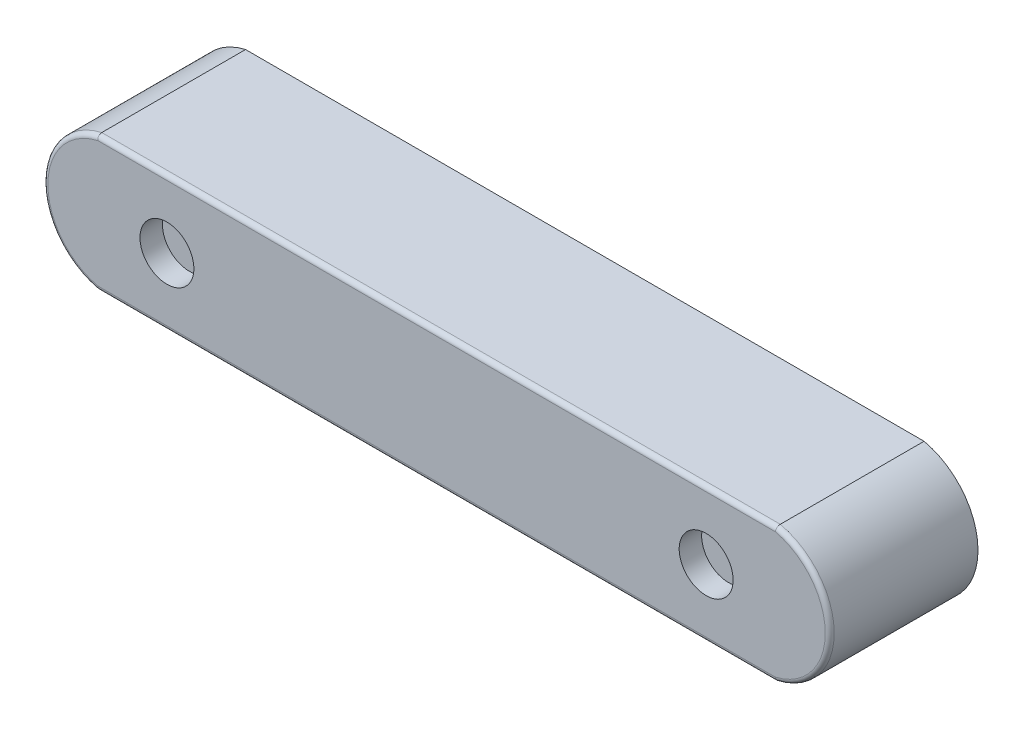
ISO-10303-21;
HEADER;
FILE_DESCRIPTION(('STEP AP214'),'2;1');
FILE_NAME('part.step','',(''),(''),'','','');
FILE_SCHEMA(('AUTOMOTIVE_DESIGN { 1 0 10303 214 1 1 1 1 }'));
ENDSEC;
DATA;
#1=APPLICATION_CONTEXT('core data for automotive mechanical design processes');
#2=APPLICATION_PROTOCOL_DEFINITION('international standard','automotive_design',2000,#1);
#3=PRODUCT_CONTEXT('',#1,'mechanical');
#4=PRODUCT('Part','Part','',(#3));
#5=PRODUCT_RELATED_PRODUCT_CATEGORY('part','',(#4));
#6=PRODUCT_DEFINITION_FORMATION('','',#4);
#7=PRODUCT_DEFINITION_CONTEXT('part definition',#1,'design');
#8=PRODUCT_DEFINITION('design','',#6,#7);
#9=PRODUCT_DEFINITION_SHAPE('','',#8);
#10=(LENGTH_UNIT() NAMED_UNIT(*) SI_UNIT(.MILLI.,.METRE.));
#11=(NAMED_UNIT(*) PLANE_ANGLE_UNIT() SI_UNIT($,.RADIAN.));
#12=(NAMED_UNIT(*) SI_UNIT($,.STERADIAN.) SOLID_ANGLE_UNIT());
#13=UNCERTAINTY_MEASURE_WITH_UNIT(LENGTH_MEASURE(1.E-05),#10,'distance_accuracy_value','');
#14=(GEOMETRIC_REPRESENTATION_CONTEXT(3) GLOBAL_UNCERTAINTY_ASSIGNED_CONTEXT((#13)) GLOBAL_UNIT_ASSIGNED_CONTEXT((#10,
#11,#12)) REPRESENTATION_CONTEXT('',''));
#15=CARTESIAN_POINT('',(0.,0.,0.));
#16=DIRECTION('',(0.,0.,1.));
#17=DIRECTION('',(1.,0.,0.));
#18=AXIS2_PLACEMENT_3D('',#15,#16,#17);
#19=CARTESIAN_POINT('',(-72.125,0.,33.));
#20=DIRECTION('',(0.,0.,-1.));
#21=DIRECTION('',(-1.,0.,0.));
#22=AXIS2_PLACEMENT_3D('',#19,#20,#21);
#23=CYLINDRICAL_SURFACE('',#22,15.375);
#24=DIRECTION('',(0.,0.,-1.));
#25=VECTOR('',#24,1.);
#26=CARTESIAN_POINT('',(-75.5,-15.,33.));
#27=LINE('',#26,#25);
#28=CARTESIAN_POINT('',(-75.5,-15.,32.));
#29=VERTEX_POINT('',#28);
#30=CARTESIAN_POINT('',(-75.5,-15.,0.));
#31=VERTEX_POINT('',#30);
#32=EDGE_CURVE('E88',#29,#31,#27,.T.);
#33=ORIENTED_EDGE('',*,*,#32,.F.);
#34=CARTESIAN_POINT('',(-72.125,0.,32.));
#35=DIRECTION('',(0.,0.,1.));
#36=DIRECTION('',(1.,0.,0.));
#37=AXIS2_PLACEMENT_3D('',#34,#35,#36);
#38=CIRCLE('',#37,15.375);
#39=CARTESIAN_POINT('',(-75.5,15.,32.));
#40=VERTEX_POINT('',#39);
#41=EDGE_CURVE('E44',#29,#40,#38,.F.);
#42=ORIENTED_EDGE('',*,*,#41,.T.);
#43=DIRECTION('',(0.,0.,-1.));
#44=VECTOR('',#43,1.);
#45=CARTESIAN_POINT('',(-75.5,15.,33.));
#46=LINE('',#45,#44);
#47=CARTESIAN_POINT('',(-75.5,15.,0.));
#48=VERTEX_POINT('',#47);
#49=EDGE_CURVE('E108',#40,#48,#46,.T.);
#50=ORIENTED_EDGE('',*,*,#49,.T.);
#51=CARTESIAN_POINT('',(-72.125,0.,0.));
#52=DIRECTION('',(0.,0.,1.));
#53=DIRECTION('',(1.,0.,0.));
#54=AXIS2_PLACEMENT_3D('',#51,#52,#53);
#55=CIRCLE('',#54,15.375);
#56=EDGE_CURVE('E103',#48,#31,#55,.T.);
#57=ORIENTED_EDGE('',*,*,#56,.T.);
#58=EDGE_LOOP('',(#33,#42,#50,#57));
#59=FACE_BOUND('',#58,.T.);
#60=ADVANCED_FACE('F35',(#59),#23,.T.);
#61=CARTESIAN_POINT('',(-75.5,-15.,33.));
#62=DIRECTION('',(0.,1.,0.));
#63=DIRECTION('',(-1.,0.,0.));
#64=AXIS2_PLACEMENT_3D('',#61,#62,#63);
#65=PLANE('',#64);
#66=CARTESIAN_POINT('',(0.,-15.,15.6));
#67=DIRECTION('',(0.,-1.,0.));
#68=DIRECTION('',(1.,0.,0.));
#69=AXIS2_PLACEMENT_3D('',#66,#67,#68);
#70=CIRCLE('',#69,4.46);
#71=CARTESIAN_POINT('',(4.45999999999999,-15.,15.6));
#72=VERTEX_POINT('',#71);
#73=EDGE_CURVE('E382',#72,#72,#70,.T.);
#74=ORIENTED_EDGE('',*,*,#73,.F.);
#75=EDGE_LOOP('',(#74));
#76=FACE_BOUND('',#75,.T.);
#77=DIRECTION('',(0.,0.,-1.));
#78=VECTOR('',#77,1.);
#79=CARTESIAN_POINT('',(75.5,-15.,33.));
#80=LINE('',#79,#78);
#81=CARTESIAN_POINT('',(75.5,-15.,32.));
#82=VERTEX_POINT('',#81);
#83=CARTESIAN_POINT('',(75.5,-15.,0.));
#84=VERTEX_POINT('',#83);
#85=EDGE_CURVE('E97',#82,#84,#80,.T.);
#86=ORIENTED_EDGE('',*,*,#85,.F.);
#87=DIRECTION('',(1.,0.,0.));
#88=VECTOR('',#87,1.);
#89=CARTESIAN_POINT('',(-75.5,-15.,32.));
#90=LINE('',#89,#88);
#91=EDGE_CURVE('E51',#82,#29,#90,.F.);
#92=ORIENTED_EDGE('',*,*,#91,.T.);
#93=ORIENTED_EDGE('',*,*,#32,.T.);
#94=DIRECTION('',(1.,0.,0.));
#95=VECTOR('',#94,1.);
#96=CARTESIAN_POINT('',(-75.5,-15.,0.));
#97=LINE('',#96,#95);
#98=EDGE_CURVE('E91',#31,#84,#97,.T.);
#99=ORIENTED_EDGE('',*,*,#98,.T.);
#100=EDGE_LOOP('',(#86,#92,#93,#99));
#101=FACE_BOUND('',#100,.T.);
#102=ADVANCED_FACE('F90',(#76,#101),#65,.F.);
#103=CARTESIAN_POINT('',(72.125,0.,33.));
#104=DIRECTION('',(0.,0.,-1.));
#105=DIRECTION('',(-1.,0.,0.));
#106=AXIS2_PLACEMENT_3D('',#103,#104,#105);
#107=CYLINDRICAL_SURFACE('',#106,15.375);
#108=DIRECTION('',(0.,0.,-1.));
#109=VECTOR('',#108,1.);
#110=CARTESIAN_POINT('',(75.5,15.,33.));
#111=LINE('',#110,#109);
#112=CARTESIAN_POINT('',(75.5,15.,32.));
#113=VERTEX_POINT('',#112);
#114=CARTESIAN_POINT('',(75.5,15.,0.));
#115=VERTEX_POINT('',#114);
#116=EDGE_CURVE('E122',#113,#115,#111,.T.);
#117=ORIENTED_EDGE('',*,*,#116,.F.);
#118=CARTESIAN_POINT('',(72.125,0.,32.));
#119=DIRECTION('',(0.,0.,1.));
#120=DIRECTION('',(1.,0.,0.));
#121=AXIS2_PLACEMENT_3D('',#118,#119,#120);
#122=CIRCLE('',#121,15.375);
#123=EDGE_CURVE('E59',#113,#82,#122,.F.);
#124=ORIENTED_EDGE('',*,*,#123,.T.);
#125=ORIENTED_EDGE('',*,*,#85,.T.);
#126=CARTESIAN_POINT('',(72.125,0.,0.));
#127=DIRECTION('',(0.,0.,1.));
#128=DIRECTION('',(-1.,0.,0.));
#129=AXIS2_PLACEMENT_3D('',#126,#127,#128);
#130=CIRCLE('',#129,15.375);
#131=EDGE_CURVE('E105',#84,#115,#130,.T.);
#132=ORIENTED_EDGE('',*,*,#131,.T.);
#133=EDGE_LOOP('',(#117,#124,#125,#132));
#134=FACE_BOUND('',#133,.T.);
#135=ADVANCED_FACE('F181',(#134),#107,.T.);
#136=CARTESIAN_POINT('',(-75.5,15.,33.));
#137=DIRECTION('',(0.,-1.,0.));
#138=DIRECTION('',(0.,0.,-1.));
#139=AXIS2_PLACEMENT_3D('',#136,#137,#138);
#140=PLANE('',#139);
#141=ORIENTED_EDGE('',*,*,#49,.F.);
#142=DIRECTION('',(-1.,0.,0.));
#143=VECTOR('',#142,1.);
#144=CARTESIAN_POINT('',(75.5,15.,32.));
#145=LINE('',#144,#143);
#146=EDGE_CURVE('E133',#40,#113,#145,.F.);
#147=ORIENTED_EDGE('',*,*,#146,.T.);
#148=ORIENTED_EDGE('',*,*,#116,.T.);
#149=DIRECTION('',(-1.,0.,0.));
#150=VECTOR('',#149,1.);
#151=CARTESIAN_POINT('',(-75.5,15.,0.));
#152=LINE('',#151,#150);
#153=EDGE_CURVE('E119',#115,#48,#152,.T.);
#154=ORIENTED_EDGE('',*,*,#153,.T.);
#155=EDGE_LOOP('',(#141,#147,#148,#154));
#156=FACE_BOUND('',#155,.T.);
#157=ADVANCED_FACE('F180',(#156),#140,.F.);
#158=CARTESIAN_POINT('',(-72.125,0.,33.));
#159=DIRECTION('',(0.,0.,1.));
#160=DIRECTION('',(1.,0.,0.));
#161=AXIS2_PLACEMENT_3D('',#158,#159,#160);
#162=PLANE('',#161);
#163=CARTESIAN_POINT('',(60.,0.,33.));
#164=DIRECTION('',(0.,0.,1.));
#165=DIRECTION('',(1.,0.,0.));
#166=AXIS2_PLACEMENT_3D('',#163,#164,#165);
#167=CIRCLE('',#166,5.99999999999999);
#168=CARTESIAN_POINT('',(66.,0.,33.));
#169=VERTEX_POINT('',#168);
#170=EDGE_CURVE('E387',#169,#169,#167,.T.);
#171=ORIENTED_EDGE('',*,*,#170,.F.);
#172=EDGE_LOOP('',(#171));
#173=FACE_BOUND('',#172,.T.);
#174=CARTESIAN_POINT('',(-60.,0.,33.));
#175=DIRECTION('',(0.,0.,1.));
#176=DIRECTION('',(1.,0.,0.));
#177=AXIS2_PLACEMENT_3D('',#174,#175,#176);
#178=CIRCLE('',#177,6.);
#179=CARTESIAN_POINT('',(-54.,0.,33.));
#180=VERTEX_POINT('',#179);
#181=EDGE_CURVE('E115',#180,#180,#178,.T.);
#182=ORIENTED_EDGE('',*,*,#181,.F.);
#183=EDGE_LOOP('',(#182));
#184=FACE_BOUND('',#183,.T.);
#185=CARTESIAN_POINT('',(72.125,0.,33.));
#186=DIRECTION('',(0.,0.,1.));
#187=DIRECTION('',(1.,0.,0.));
#188=AXIS2_PLACEMENT_3D('',#185,#186,#187);
#189=CIRCLE('',#188,14.375);
#190=CARTESIAN_POINT('',(75.386997087675,-14.,33.));
#191=VERTEX_POINT('',#190);
#192=CARTESIAN_POINT('',(75.386997087675,14.,33.));
#193=VERTEX_POINT('',#192);
#194=EDGE_CURVE('E128',#191,#193,#189,.T.);
#195=ORIENTED_EDGE('',*,*,#194,.T.);
#196=DIRECTION('',(-1.,0.,0.));
#197=VECTOR('',#196,1.);
#198=CARTESIAN_POINT('',(-75.5,14.,33.));
#199=LINE('',#198,#197);
#200=CARTESIAN_POINT('',(-75.386997087675,14.,33.));
#201=VERTEX_POINT('',#200);
#202=EDGE_CURVE('E130',#193,#201,#199,.T.);
#203=ORIENTED_EDGE('',*,*,#202,.T.);
#204=CARTESIAN_POINT('',(-72.125,0.,33.));
#205=DIRECTION('',(0.,0.,1.));
#206=DIRECTION('',(1.,0.,0.));
#207=AXIS2_PLACEMENT_3D('',#204,#205,#206);
#208=CIRCLE('',#207,14.375);
#209=CARTESIAN_POINT('',(-75.386997087675,-14.,33.));
#210=VERTEX_POINT('',#209);
#211=EDGE_CURVE('E96',#201,#210,#208,.T.);
#212=ORIENTED_EDGE('',*,*,#211,.T.);
#213=DIRECTION('',(1.,0.,0.));
#214=VECTOR('',#213,1.);
#215=CARTESIAN_POINT('',(75.5,-14.,33.));
#216=LINE('',#215,#214);
#217=EDGE_CURVE('E126',#210,#191,#216,.T.);
#218=ORIENTED_EDGE('',*,*,#217,.T.);
#219=EDGE_LOOP('',(#195,#203,#212,#218));
#220=FACE_BOUND('',#219,.T.);
#221=ADVANCED_FACE('F185',(#173,#184,#220),#162,.T.);
#222=CARTESIAN_POINT('',(-72.125,0.,0.));
#223=DIRECTION('',(0.,0.,1.));
#224=DIRECTION('',(1.,0.,0.));
#225=AXIS2_PLACEMENT_3D('',#222,#223,#224);
#226=PLANE('',#225);
#227=CARTESIAN_POINT('',(0.,-9.99999999999997,0.));
#228=DIRECTION('',(0.,0.,1.));
#229=DIRECTION('',(1.,0.,0.));
#230=AXIS2_PLACEMENT_3D('',#227,#228,#229);
#231=CIRCLE('',#230,2.);
#232=CARTESIAN_POINT('',(2.,-9.99999999999997,0.));
#233=VERTEX_POINT('',#232);
#234=EDGE_CURVE('E11',#233,#233,#231,.F.);
#235=ORIENTED_EDGE('',*,*,#234,.F.);
#236=EDGE_LOOP('',(#235));
#237=FACE_BOUND('',#236,.T.);
#238=ORIENTED_EDGE('',*,*,#56,.F.);
#239=ORIENTED_EDGE('',*,*,#153,.F.);
#240=ORIENTED_EDGE('',*,*,#131,.F.);
#241=ORIENTED_EDGE('',*,*,#98,.F.);
#242=EDGE_LOOP('',(#238,#239,#240,#241));
#243=FACE_BOUND('',#242,.T.);
#244=ADVANCED_FACE('F101',(#237,#243),#226,.F.);
#245=CARTESIAN_POINT('',(-72.125,-14.,32.));
#246=DIRECTION('',(-1.,0.,0.));
#247=DIRECTION('',(0.,-1.,0.));
#248=AXIS2_PLACEMENT_3D('',#245,#246,#247);
#249=CYLINDRICAL_SURFACE('',#248,1.);
#250=CARTESIAN_POINT('',(-75.5,-15.,32.));
#251=CARTESIAN_POINT('',(-75.499999964674,-14.999999904069,32.0280075921913));
#252=CARTESIAN_POINT('',(-75.4998691822479,-14.9988226159024,32.0560017235617));
#253=CARTESIAN_POINT('',(-75.4993473457388,-14.994126545182,32.111788744704));
#254=CARTESIAN_POINT('',(-75.4989563071951,-14.990607902425,32.1395816463908));
#255=CARTESIAN_POINT('',(-75.4973964411671,-14.9765754690892,32.2223053710667));
#256=CARTESIAN_POINT('',(-75.4958408530623,-14.9625850690083,32.2766805353644));
#257=CARTESIAN_POINT('',(-75.4917389311392,-14.9257358300069,32.3822915327908));
#258=CARTESIAN_POINT('',(-75.4891921831668,-14.9028732838908,32.4335260432318));
#259=CARTESIAN_POINT('',(-75.4831760705017,-14.8489500074775,32.5314170414158));
#260=CARTESIAN_POINT('',(-75.4797068777712,-14.817890805209,32.5780743802183));
#261=CARTESIAN_POINT('',(-75.4719277514656,-14.7483803307268,32.6656276557366));
#262=CARTESIAN_POINT('',(-75.467615658569,-14.7099100768017,32.7065083204121));
#263=CARTESIAN_POINT('',(-75.4582695340125,-14.6267186595717,32.7812495970753));
#264=CARTESIAN_POINT('',(-75.4532352604924,-14.5819954022474,32.8151078479097));
#265=CARTESIAN_POINT('',(-75.442548278371,-14.4872971608125,32.8750440828348));
#266=CARTESIAN_POINT('',(-75.4368920058979,-14.4372919849175,32.9010736599481));
#267=CARTESIAN_POINT('',(-75.4251400590818,-14.333686700491,32.944350918401));
#268=CARTESIAN_POINT('',(-75.4190447224892,-14.2800893573992,32.9616052694441));
#269=CARTESIAN_POINT('',(-75.4088437740247,-14.1906520506433,32.982310761774));
#270=CARTESIAN_POINT('',(-75.4048168093767,-14.1554090048299,32.9884976778408));
#271=CARTESIAN_POINT('',(-75.3967000469693,-14.0845064076868,32.9970603308654));
#272=CARTESIAN_POINT('',(-75.3926103598681,-14.0488476117025,32.9994421406602));
#273=CARTESIAN_POINT('',(-75.3880078302292,-14.0087931211266,32.9999710700288));
#274=CARTESIAN_POINT('',(-75.3875024916347,-14.0043963299809,33.0000000762739));
#275=CARTESIAN_POINT('',(-75.386997087675,-14.,33.));
#276=B_SPLINE_CURVE_WITH_KNOTS('',3,(#250,#251,#252,#253,#254,#255,#256,#257,#258,#259,#260,
#261,#262,#263,#264,#265,#266,#267,#268,#269,#270,#271,#272,#273,#274,#275),.UNSPECIFIED.,.F.,
.F.,(4,2,2,2,2,2,2,2,2,2,2,2,4),(0.,0.0839710221818349,0.167937031096377,0.335574886844235,
0.503282865041634,0.670959601007382,0.839071653897695,1.00724013997061,1.17642803841149,
1.34548715089566,1.45333498703413,1.56101052864617,1.57428757464835),.UNSPECIFIED.);
#277=EDGE_CURVE('E113',#29,#210,#276,.T.);
#278=ORIENTED_EDGE('',*,*,#277,.F.);
#279=ORIENTED_EDGE('',*,*,#91,.F.);
#280=CARTESIAN_POINT('',(75.5,-15.,32.));
#281=CARTESIAN_POINT('',(75.499999964674,-14.999999904069,32.0280075921913));
#282=CARTESIAN_POINT('',(75.4998691822479,-14.9988226159024,32.0560017235617));
#283=CARTESIAN_POINT('',(75.4993473457388,-14.9941265451819,32.111788744704));
#284=CARTESIAN_POINT('',(75.4989563071951,-14.990607902425,32.1395816463908));
#285=CARTESIAN_POINT('',(75.497396441167,-14.9765754690891,32.2223053710667));
#286=CARTESIAN_POINT('',(75.4958408530623,-14.9625850690083,32.2766805353644));
#287=CARTESIAN_POINT('',(75.4917389311392,-14.9257358300068,32.3822915327908));
#288=CARTESIAN_POINT('',(75.4891921831668,-14.9028732838908,32.4335260432318));
#289=CARTESIAN_POINT('',(75.4831760705017,-14.8489500074774,32.5314170414158));
#290=CARTESIAN_POINT('',(75.4797068777712,-14.817890805209,32.5780743802183));
#291=CARTESIAN_POINT('',(75.4719277514656,-14.7483803307268,32.6656276557366));
#292=CARTESIAN_POINT('',(75.4676156585689,-14.7099100768017,32.7065083204121));
#293=CARTESIAN_POINT('',(75.4582695340124,-14.6267186595717,32.7812495970753));
#294=CARTESIAN_POINT('',(75.4532352604923,-14.5819954022473,32.8151078479097));
#295=CARTESIAN_POINT('',(75.442548278371,-14.4872971608125,32.8750440828348));
#296=CARTESIAN_POINT('',(75.4368920058979,-14.4372919849175,32.9010736599481));
#297=CARTESIAN_POINT('',(75.4251400590817,-14.333686700491,32.944350918401));
#298=CARTESIAN_POINT('',(75.4190447224892,-14.2800893573992,32.9616052694441));
#299=CARTESIAN_POINT('',(75.4088437740247,-14.1906520506432,32.982310761774));
#300=CARTESIAN_POINT('',(75.4048168093766,-14.1554090048299,32.9884976778408));
#301=CARTESIAN_POINT('',(75.3967000469693,-14.0845064076868,32.9970603308654));
#302=CARTESIAN_POINT('',(75.3926103598681,-14.0488476117024,32.9994421406602));
#303=CARTESIAN_POINT('',(75.3880078302292,-14.0087931211265,32.9999710700288));
#304=CARTESIAN_POINT('',(75.3875024916347,-14.0043963299809,33.0000000762739));
#305=CARTESIAN_POINT('',(75.3869970876749,-14.,33.));
#306=B_SPLINE_CURVE_WITH_KNOTS('',3,(#280,#281,#282,#283,#284,#285,#286,#287,#288,#289,#290,
#291,#292,#293,#294,#295,#296,#297,#298,#299,#300,#301,#302,#303,#304,#305),.UNSPECIFIED.,.F.,
.F.,(4,2,2,2,2,2,2,2,2,2,2,2,4),(0.,0.0839710221818349,0.167937031096377,0.335574886844235,
0.503282865041625,0.670959601007382,0.83907165389769,1.00724013997061,1.17642803841149,
1.34548715089566,1.45333498703413,1.56101052864617,1.57428757464835),.UNSPECIFIED.);
#307=EDGE_CURVE('E110',#191,#82,#306,.F.);
#308=ORIENTED_EDGE('',*,*,#307,.F.);
#309=ORIENTED_EDGE('',*,*,#217,.F.);
#310=EDGE_LOOP('',(#278,#279,#308,#309));
#311=FACE_BOUND('',#310,.T.);
#312=ADVANCED_FACE('F37',(#311),#249,.T.);
#313=CARTESIAN_POINT('',(72.125,0.,32.));
#314=DIRECTION('',(0.,0.,1.));
#315=DIRECTION('',(1.,0.,0.));
#316=AXIS2_PLACEMENT_3D('',#313,#314,#315);
#317=TOROIDAL_SURFACE('',#316,14.375,1.);
#318=ORIENTED_EDGE('',*,*,#307,.T.);
#319=ORIENTED_EDGE('',*,*,#123,.F.);
#320=CARTESIAN_POINT('',(75.5,15.,32.));
#321=CARTESIAN_POINT('',(75.499999964674,14.9999999040689,32.0280075921913));
#322=CARTESIAN_POINT('',(75.4998691822479,14.9988226159024,32.0560017235617));
#323=CARTESIAN_POINT('',(75.4993473457388,14.9941265451819,32.111788744704));
#324=CARTESIAN_POINT('',(75.4989563071951,14.990607902425,32.1395816463908));
#325=CARTESIAN_POINT('',(75.497396441167,14.9765754690891,32.2223053710667));
#326=CARTESIAN_POINT('',(75.4958408530623,14.9625850690083,32.2766805353644));
#327=CARTESIAN_POINT('',(75.4917389311392,14.9257358300068,32.3822915327908));
#328=CARTESIAN_POINT('',(75.4891921831668,14.9028732838908,32.4335260432318));
#329=CARTESIAN_POINT('',(75.4831760705017,14.8489500074774,32.5314170414158));
#330=CARTESIAN_POINT('',(75.4797068777712,14.817890805209,32.5780743802183));
#331=CARTESIAN_POINT('',(75.4719277514656,14.7483803307268,32.6656276557366));
#332=CARTESIAN_POINT('',(75.4676156585689,14.7099100768016,32.7065083204121));
#333=CARTESIAN_POINT('',(75.4582695340124,14.6267186595717,32.7812495970753));
#334=CARTESIAN_POINT('',(75.4532352604924,14.5819954022473,32.8151078479097));
#335=CARTESIAN_POINT('',(75.442548278371,14.4872971608125,32.8750440828348));
#336=CARTESIAN_POINT('',(75.4368920058979,14.4372919849175,32.9010736599481));
#337=CARTESIAN_POINT('',(75.4251400590818,14.333686700491,32.944350918401));
#338=CARTESIAN_POINT('',(75.4190447224892,14.2800893573992,32.9616052694441));
#339=CARTESIAN_POINT('',(75.4088437740246,14.1906520506432,32.982310761774));
#340=CARTESIAN_POINT('',(75.4048168093766,14.1554090048299,32.9884976778408));
#341=CARTESIAN_POINT('',(75.3967000469694,14.0845064076868,32.9970603308654));
#342=CARTESIAN_POINT('',(75.3926103598683,14.0488476117024,32.9994421406602));
#343=CARTESIAN_POINT('',(75.3880078302292,14.0087931211265,32.9999710700288));
#344=CARTESIAN_POINT('',(75.3875024916347,14.0043963299809,33.0000000762739));
#345=CARTESIAN_POINT('',(75.386997087675,14.,33.));
#346=B_SPLINE_CURVE_WITH_KNOTS('',3,(#320,#321,#322,#323,#324,#325,#326,#327,#328,#329,#330,
#331,#332,#333,#334,#335,#336,#337,#338,#339,#340,#341,#342,#343,#344,#345),.UNSPECIFIED.,.F.,
.F.,(4,2,2,2,2,2,2,2,2,2,2,2,4),(0.,0.0839710221818349,0.167937031096377,0.335574886844235,
0.503282865041626,0.670959601007382,0.839071653897696,1.00724013997061,1.17642803841149,
1.34548715089566,1.45333498703413,1.56101052864616,1.57428757464835),.UNSPECIFIED.);
#347=EDGE_CURVE('E146',#193,#113,#346,.F.);
#348=ORIENTED_EDGE('',*,*,#347,.F.);
#349=ORIENTED_EDGE('',*,*,#194,.F.);
#350=EDGE_LOOP('',(#318,#319,#348,#349));
#351=FACE_BOUND('',#350,.T.);
#352=ADVANCED_FACE('F158',(#351),#317,.T.);
#353=CARTESIAN_POINT('',(-72.125,0.,32.));
#354=DIRECTION('',(0.,0.,1.));
#355=DIRECTION('',(1.,0.,0.));
#356=AXIS2_PLACEMENT_3D('',#353,#354,#355);
#357=TOROIDAL_SURFACE('',#356,14.375,1.);
#358=ORIENTED_EDGE('',*,*,#277,.T.);
#359=ORIENTED_EDGE('',*,*,#211,.F.);
#360=CARTESIAN_POINT('',(-75.5,15.,32.));
#361=CARTESIAN_POINT('',(-75.499999964674,14.9999999040689,32.0280075921913));
#362=CARTESIAN_POINT('',(-75.4998691822479,14.9988226159024,32.0560017235617));
#363=CARTESIAN_POINT('',(-75.4993473457388,14.9941265451819,32.111788744704));
#364=CARTESIAN_POINT('',(-75.4989563071951,14.990607902425,32.1395816463908));
#365=CARTESIAN_POINT('',(-75.4973964411671,14.9765754690891,32.2223053710667));
#366=CARTESIAN_POINT('',(-75.4958408530623,14.9625850690083,32.2766805353644));
#367=CARTESIAN_POINT('',(-75.4917389311392,14.9257358300068,32.3822915327908));
#368=CARTESIAN_POINT('',(-75.4891921831668,14.9028732838908,32.4335260432318));
#369=CARTESIAN_POINT('',(-75.4831760705017,14.8489500074774,32.5314170414158));
#370=CARTESIAN_POINT('',(-75.4797068777712,14.817890805209,32.5780743802183));
#371=CARTESIAN_POINT('',(-75.4719277514656,14.7483803307268,32.6656276557366));
#372=CARTESIAN_POINT('',(-75.467615658569,14.7099100768016,32.7065083204121));
#373=CARTESIAN_POINT('',(-75.4582695340125,14.6267186595717,32.7812495970753));
#374=CARTESIAN_POINT('',(-75.4532352604924,14.5819954022473,32.8151078479097));
#375=CARTESIAN_POINT('',(-75.442548278371,14.4872971608125,32.8750440828348));
#376=CARTESIAN_POINT('',(-75.4368920058979,14.4372919849175,32.9010736599481));
#377=CARTESIAN_POINT('',(-75.4251400590818,14.333686700491,32.944350918401));
#378=CARTESIAN_POINT('',(-75.4190447224893,14.2800893573992,32.9616052694441));
#379=CARTESIAN_POINT('',(-75.4088437740247,14.1906520506432,32.982310761774));
#380=CARTESIAN_POINT('',(-75.4048168093766,14.1554090048299,32.9884976778408));
#381=CARTESIAN_POINT('',(-75.3967000469694,14.0845064076868,32.9970603308654));
#382=CARTESIAN_POINT('',(-75.3926103598685,14.0488476117024,32.9994421406602));
#383=CARTESIAN_POINT('',(-75.3880078302293,14.0087931211265,32.9999710700288));
#384=CARTESIAN_POINT('',(-75.3875024916348,14.0043963299809,33.0000000762739));
#385=CARTESIAN_POINT('',(-75.386997087675,14.,33.));
#386=B_SPLINE_CURVE_WITH_KNOTS('',3,(#360,#361,#362,#363,#364,#365,#366,#367,#368,#369,#370,
#371,#372,#373,#374,#375,#376,#377,#378,#379,#380,#381,#382,#383,#384,#385),.UNSPECIFIED.,.F.,
.F.,(4,2,2,2,2,2,2,2,2,2,2,2,4),(0.,0.0839710221818349,0.167937031096377,0.335574886844235,
0.503282865041625,0.670959601007383,0.839071653897696,1.00724013997061,1.17642803841149,
1.34548715089566,1.45333498703413,1.56101052864617,1.57428757464835),.UNSPECIFIED.);
#387=EDGE_CURVE('E139',#40,#201,#386,.T.);
#388=ORIENTED_EDGE('',*,*,#387,.F.);
#389=ORIENTED_EDGE('',*,*,#41,.F.);
#390=EDGE_LOOP('',(#358,#359,#388,#389));
#391=FACE_BOUND('',#390,.T.);
#392=ADVANCED_FACE('F155',(#391),#357,.T.);
#393=CARTESIAN_POINT('',(-72.125,14.,32.));
#394=DIRECTION('',(1.,0.,0.));
#395=DIRECTION('',(0.,0.,-1.));
#396=AXIS2_PLACEMENT_3D('',#393,#394,#395);
#397=CYLINDRICAL_SURFACE('',#396,1.);
#398=ORIENTED_EDGE('',*,*,#347,.T.);
#399=ORIENTED_EDGE('',*,*,#146,.F.);
#400=ORIENTED_EDGE('',*,*,#387,.T.);
#401=ORIENTED_EDGE('',*,*,#202,.F.);
#402=EDGE_LOOP('',(#398,#399,#400,#401));
#403=FACE_BOUND('',#402,.T.);
#404=ADVANCED_FACE('F152',(#403),#397,.T.);
#405=CARTESIAN_POINT('',(-60.,0.,28.));
#406=DIRECTION('',(0.,0.,1.));
#407=DIRECTION('',(1.,0.,0.));
#408=AXIS2_PLACEMENT_3D('',#405,#406,#407);
#409=CYLINDRICAL_SURFACE('',#408,6.);
#410=CARTESIAN_POINT('',(-60.,0.,28.));
#411=DIRECTION('',(0.,0.,1.));
#412=DIRECTION('',(1.,0.,0.));
#413=AXIS2_PLACEMENT_3D('',#410,#411,#412);
#414=CIRCLE('',#413,6.);
#415=CARTESIAN_POINT('',(-54.,0.,28.));
#416=VERTEX_POINT('',#415);
#417=EDGE_CURVE('E147',#416,#416,#414,.T.);
#418=ORIENTED_EDGE('',*,*,#417,.F.);
#419=EDGE_LOOP('',(#418));
#420=FACE_BOUND('',#419,.T.);
#421=ORIENTED_EDGE('',*,*,#181,.T.);
#422=EDGE_LOOP('',(#421));
#423=FACE_BOUND('',#422,.T.);
#424=ADVANCED_FACE('F246',(#420,#423),#409,.F.);
#425=CARTESIAN_POINT('',(-60.,0.,28.));
#426=DIRECTION('',(0.,0.,1.));
#427=DIRECTION('',(1.,0.,0.));
#428=AXIS2_PLACEMENT_3D('',#425,#426,#427);
#429=PLANE('',#428);
#430=ORIENTED_EDGE('',*,*,#417,.T.);
#431=EDGE_LOOP('',(#430));
#432=FACE_BOUND('',#431,.T.);
#433=ADVANCED_FACE('F262',(#432),#429,.T.);
#434=CARTESIAN_POINT('',(60.,0.,28.));
#435=DIRECTION('',(0.,0.,1.));
#436=DIRECTION('',(1.,0.,0.));
#437=AXIS2_PLACEMENT_3D('',#434,#435,#436);
#438=CYLINDRICAL_SURFACE('',#437,5.99999999999999);
#439=CARTESIAN_POINT('',(60.,0.,28.));
#440=DIRECTION('',(0.,0.,1.));
#441=DIRECTION('',(1.,0.,0.));
#442=AXIS2_PLACEMENT_3D('',#439,#440,#441);
#443=CIRCLE('',#442,5.99999999999999);
#444=CARTESIAN_POINT('',(66.,0.,28.));
#445=VERTEX_POINT('',#444);
#446=EDGE_CURVE('E390',#445,#445,#443,.T.);
#447=ORIENTED_EDGE('',*,*,#446,.F.);
#448=EDGE_LOOP('',(#447));
#449=FACE_BOUND('',#448,.T.);
#450=ORIENTED_EDGE('',*,*,#170,.T.);
#451=EDGE_LOOP('',(#450));
#452=FACE_BOUND('',#451,.T.);
#453=ADVANCED_FACE('F272',(#449,#452),#438,.F.);
#454=CARTESIAN_POINT('',(60.,0.,28.));
#455=DIRECTION('',(0.,0.,1.));
#456=DIRECTION('',(1.,0.,0.));
#457=AXIS2_PLACEMENT_3D('',#454,#455,#456);
#458=PLANE('',#457);
#459=ORIENTED_EDGE('',*,*,#446,.T.);
#460=EDGE_LOOP('',(#459));
#461=FACE_BOUND('',#460,.T.);
#462=ADVANCED_FACE('F283',(#461),#458,.T.);
#463=CARTESIAN_POINT('',(0.,-13.,15.6));
#464=DIRECTION('',(0.,-1.,0.));
#465=DIRECTION('',(1.,0.,0.));
#466=AXIS2_PLACEMENT_3D('',#463,#464,#465);
#467=CYLINDRICAL_SURFACE('',#466,4.46);
#468=CARTESIAN_POINT('',(0.,-13.,15.6));
#469=DIRECTION('',(0.,-1.,0.));
#470=DIRECTION('',(1.,0.,0.));
#471=AXIS2_PLACEMENT_3D('',#468,#469,#470);
#472=CIRCLE('',#471,4.46);
#473=CARTESIAN_POINT('',(4.45999999999999,-13.,15.6));
#474=VERTEX_POINT('',#473);
#475=EDGE_CURVE('E384',#474,#474,#472,.T.);
#476=ORIENTED_EDGE('',*,*,#475,.F.);
#477=EDGE_LOOP('',(#476));
#478=FACE_BOUND('',#477,.T.);
#479=ORIENTED_EDGE('',*,*,#73,.T.);
#480=EDGE_LOOP('',(#479));
#481=FACE_BOUND('',#480,.T.);
#482=ADVANCED_FACE('F292',(#478,#481),#467,.F.);
#483=CARTESIAN_POINT('',(0.,-13.,15.6));
#484=DIRECTION('',(0.,-1.,0.));
#485=DIRECTION('',(1.,0.,0.));
#486=AXIS2_PLACEMENT_3D('',#483,#484,#485);
#487=PLANE('',#486);
#488=CARTESIAN_POINT('',(0.,-13.,15.6));
#489=DIRECTION('',(0.,-1.,0.));
#490=DIRECTION('',(1.,0.,0.));
#491=AXIS2_PLACEMENT_3D('',#488,#489,#490);
#492=CIRCLE('',#491,2.65);
#493=CARTESIAN_POINT('',(2.64999999999999,-13.,15.6));
#494=VERTEX_POINT('',#493);
#495=EDGE_CURVE('E375',#494,#494,#492,.T.);
#496=ORIENTED_EDGE('',*,*,#495,.F.);
#497=EDGE_LOOP('',(#496));
#498=FACE_BOUND('',#497,.T.);
#499=ORIENTED_EDGE('',*,*,#475,.T.);
#500=EDGE_LOOP('',(#499));
#501=FACE_BOUND('',#500,.T.);
#502=ADVANCED_FACE('F308',(#498,#501),#487,.T.);
#503=CARTESIAN_POINT('',(0.,-5.,15.6));
#504=DIRECTION('',(0.,-1.,0.));
#505=DIRECTION('',(1.,0.,0.));
#506=AXIS2_PLACEMENT_3D('',#503,#504,#505);
#507=CYLINDRICAL_SURFACE('',#506,2.65);
#508=CARTESIAN_POINT('',(0.,-5.,15.6));
#509=DIRECTION('',(0.,-1.,0.));
#510=DIRECTION('',(1.,0.,0.));
#511=AXIS2_PLACEMENT_3D('',#508,#509,#510);
#512=CIRCLE('',#511,2.65);
#513=CARTESIAN_POINT('',(2.64999999999999,-5.,15.6));
#514=VERTEX_POINT('',#513);
#515=EDGE_CURVE('E378',#514,#514,#512,.T.);
#516=ORIENTED_EDGE('',*,*,#515,.F.);
#517=EDGE_LOOP('',(#516));
#518=FACE_BOUND('',#517,.T.);
#519=ORIENTED_EDGE('',*,*,#495,.T.);
#520=EDGE_LOOP('',(#519));
#521=FACE_BOUND('',#520,.T.);
#522=ADVANCED_FACE('F318',(#518,#521),#507,.F.);
#523=CARTESIAN_POINT('',(0.,-5.,15.6));
#524=DIRECTION('',(0.,-1.,0.));
#525=DIRECTION('',(1.,0.,0.));
#526=AXIS2_PLACEMENT_3D('',#523,#524,#525);
#527=PLANE('',#526);
#528=ORIENTED_EDGE('',*,*,#515,.T.);
#529=EDGE_LOOP('',(#528));
#530=FACE_BOUND('',#529,.T.);
#531=ADVANCED_FACE('F328',(#530),#527,.T.);
#532=CARTESIAN_POINT('',(0.,-9.99999999999997,-5.));
#533=DIRECTION('',(0.,0.,1.));
#534=DIRECTION('',(1.,0.,0.));
#535=AXIS2_PLACEMENT_3D('',#532,#533,#534);
#536=CYLINDRICAL_SURFACE('',#535,2.);
#537=CARTESIAN_POINT('',(0.,-9.99999999999997,-5.));
#538=DIRECTION('',(0.,0.,-1.));
#539=DIRECTION('',(-1.,0.,0.));
#540=AXIS2_PLACEMENT_3D('',#537,#538,#539);
#541=CIRCLE('',#540,2.);
#542=CARTESIAN_POINT('',(-2.,-9.99999999999997,-5.));
#543=VERTEX_POINT('',#542);
#544=EDGE_CURVE('E374',#543,#543,#541,.T.);
#545=ORIENTED_EDGE('',*,*,#544,.F.);
#546=EDGE_LOOP('',(#545));
#547=FACE_BOUND('',#546,.T.);
#548=ORIENTED_EDGE('',*,*,#234,.T.);
#549=EDGE_LOOP('',(#548));
#550=FACE_BOUND('',#549,.T.);
#551=ADVANCED_FACE('F338',(#547,#550),#536,.T.);
#552=CARTESIAN_POINT('',(0.,-9.99999999999997,-5.));
#553=DIRECTION('',(0.,0.,-1.));
#554=DIRECTION('',(-1.,0.,0.));
#555=AXIS2_PLACEMENT_3D('',#552,#553,#554);
#556=PLANE('',#555);
#557=ORIENTED_EDGE('',*,*,#544,.T.);
#558=EDGE_LOOP('',(#557));
#559=FACE_BOUND('',#558,.T.);
#560=ADVANCED_FACE('F356',(#559),#556,.T.);
#561=CLOSED_SHELL('',(#60,#102,#135,#157,#221,#244,#312,#352,#392,#404,#424,#433,#453,#462,#482,
#502,#522,#531,#551,#560));
#562=MANIFOLD_SOLID_BREP('B2',#561);
#563=ADVANCED_BREP_SHAPE_REPRESENTATION('',(#18,#562),#14);
#564=SHAPE_DEFINITION_REPRESENTATION(#9,#563);
ENDSEC;
END-ISO-10303-21;
